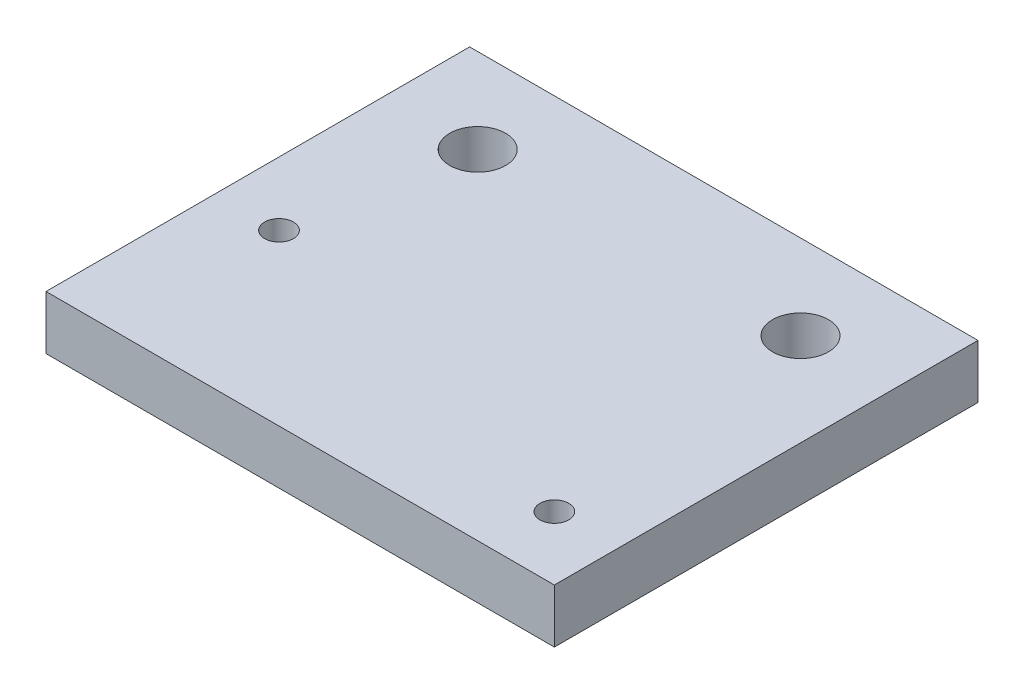
ISO-10303-21;
HEADER;
FILE_DESCRIPTION(('STEP AP214'),'2;1');
FILE_NAME('part.step','',(''),(''),'','','');
FILE_SCHEMA(('AUTOMOTIVE_DESIGN { 1 0 10303 214 1 1 1 1 }'));
ENDSEC;
DATA;
#1=APPLICATION_CONTEXT('core data for automotive mechanical design processes');
#2=APPLICATION_PROTOCOL_DEFINITION('international standard','automotive_design',2000,#1);
#3=PRODUCT_CONTEXT('',#1,'mechanical');
#4=PRODUCT('Part','Part','',(#3));
#5=PRODUCT_RELATED_PRODUCT_CATEGORY('part','',(#4));
#6=PRODUCT_DEFINITION_FORMATION('','',#4);
#7=PRODUCT_DEFINITION_CONTEXT('part definition',#1,'design');
#8=PRODUCT_DEFINITION('design','',#6,#7);
#9=PRODUCT_DEFINITION_SHAPE('','',#8);
#10=(LENGTH_UNIT() NAMED_UNIT(*) SI_UNIT(.MILLI.,.METRE.));
#11=(NAMED_UNIT(*) PLANE_ANGLE_UNIT() SI_UNIT($,.RADIAN.));
#12=(NAMED_UNIT(*) SI_UNIT($,.STERADIAN.) SOLID_ANGLE_UNIT());
#13=UNCERTAINTY_MEASURE_WITH_UNIT(LENGTH_MEASURE(1.E-05),#10,'distance_accuracy_value','');
#14=(GEOMETRIC_REPRESENTATION_CONTEXT(3) GLOBAL_UNCERTAINTY_ASSIGNED_CONTEXT((#13)) GLOBAL_UNIT_ASSIGNED_CONTEXT((#10,
#11,#12)) REPRESENTATION_CONTEXT('',''));
#15=CARTESIAN_POINT('',(0.,0.,0.));
#16=DIRECTION('',(0.,0.,1.));
#17=DIRECTION('',(1.,0.,0.));
#18=AXIS2_PLACEMENT_3D('',#15,#16,#17);
#19=CARTESIAN_POINT('',(0.,6.35,0.));
#20=DIRECTION('',(0.,1.,0.));
#21=DIRECTION('',(0.,0.,1.));
#22=AXIS2_PLACEMENT_3D('',#19,#20,#21);
#23=PLANE('',#22);
#24=CARTESIAN_POINT('',(7.5,6.35,-20.));
#25=DIRECTION('',(0.,1.,0.));
#26=DIRECTION('',(0.,0.,1.));
#27=AXIS2_PLACEMENT_3D('',#24,#25,#26);
#28=CIRCLE('',#27,1.7);
#29=CARTESIAN_POINT('',(7.5,6.35,-18.3));
#30=VERTEX_POINT('',#29);
#31=EDGE_CURVE('E145',#30,#30,#28,.T.);
#32=ORIENTED_EDGE('',*,*,#31,.F.);
#33=EDGE_LOOP('',(#32));
#34=FACE_BOUND('',#33,.T.);
#35=CARTESIAN_POINT('',(10.95,6.35,-40.));
#36=DIRECTION('',(0.,1.,0.));
#37=DIRECTION('',(0.,0.,1.));
#38=AXIS2_PLACEMENT_3D('',#35,#36,#37);
#39=CIRCLE('',#38,3.3);
#40=CARTESIAN_POINT('',(10.95,6.35,-36.7));
#41=VERTEX_POINT('',#40);
#42=EDGE_CURVE('E115',#41,#41,#39,.T.);
#43=ORIENTED_EDGE('',*,*,#42,.F.);
#44=EDGE_LOOP('',(#43));
#45=FACE_BOUND('',#44,.T.);
#46=DIRECTION('',(0.,0.,1.));
#47=VECTOR('',#46,1.);
#48=CARTESIAN_POINT('',(0.,6.35,-50.));
#49=LINE('',#48,#47);
#50=CARTESIAN_POINT('',(0.,6.35,-50.));
#51=VERTEX_POINT('',#50);
#52=CARTESIAN_POINT('',(0.,6.35,0.));
#53=VERTEX_POINT('',#52);
#54=EDGE_CURVE('E95',#51,#53,#49,.T.);
#55=ORIENTED_EDGE('',*,*,#54,.T.);
#56=DIRECTION('',(1.,0.,0.));
#57=VECTOR('',#56,1.);
#58=CARTESIAN_POINT('',(0.,6.35,0.));
#59=LINE('',#58,#57);
#60=CARTESIAN_POINT('',(60.,6.35,0.));
#61=VERTEX_POINT('',#60);
#62=EDGE_CURVE('E90',#53,#61,#59,.T.);
#63=ORIENTED_EDGE('',*,*,#62,.T.);
#64=DIRECTION('',(0.,0.,-1.));
#65=VECTOR('',#64,1.);
#66=CARTESIAN_POINT('',(60.,6.35,-50.));
#67=LINE('',#66,#65);
#68=CARTESIAN_POINT('',(60.,6.35,-50.));
#69=VERTEX_POINT('',#68);
#70=EDGE_CURVE('E93',#61,#69,#67,.T.);
#71=ORIENTED_EDGE('',*,*,#70,.T.);
#72=DIRECTION('',(-1.,0.,0.));
#73=VECTOR('',#72,1.);
#74=CARTESIAN_POINT('',(0.,6.35,-50.));
#75=LINE('',#74,#73);
#76=EDGE_CURVE('E60',#69,#51,#75,.T.);
#77=ORIENTED_EDGE('',*,*,#76,.T.);
#78=EDGE_LOOP('',(#55,#63,#71,#77));
#79=FACE_BOUND('',#78,.T.);
#80=CARTESIAN_POINT('',(49.05,6.35,-40.));
#81=DIRECTION('',(0.,1.,0.));
#82=DIRECTION('',(0.,0.,1.));
#83=AXIS2_PLACEMENT_3D('',#80,#81,#82);
#84=CIRCLE('',#83,3.3);
#85=CARTESIAN_POINT('',(49.05,6.35,-36.7));
#86=VERTEX_POINT('',#85);
#87=EDGE_CURVE('E137',#86,#86,#84,.T.);
#88=ORIENTED_EDGE('',*,*,#87,.F.);
#89=EDGE_LOOP('',(#88));
#90=FACE_BOUND('',#89,.T.);
#91=CARTESIAN_POINT('',(52.5,6.35,-7.5));
#92=DIRECTION('',(0.,1.,0.));
#93=DIRECTION('',(0.,0.,1.));
#94=AXIS2_PLACEMENT_3D('',#91,#92,#93);
#95=CIRCLE('',#94,1.7);
#96=CARTESIAN_POINT('',(52.5,6.35,-5.8));
#97=VERTEX_POINT('',#96);
#98=EDGE_CURVE('E153',#97,#97,#95,.T.);
#99=ORIENTED_EDGE('',*,*,#98,.F.);
#100=EDGE_LOOP('',(#99));
#101=FACE_BOUND('',#100,.T.);
#102=ADVANCED_FACE('F42',(#34,#45,#79,#90,#101),#23,.T.);
#103=CARTESIAN_POINT('',(0.,0.,0.));
#104=DIRECTION('',(0.,1.,0.));
#105=DIRECTION('',(0.,0.,1.));
#106=AXIS2_PLACEMENT_3D('',#103,#104,#105);
#107=PLANE('',#106);
#108=DIRECTION('',(0.,0.,1.));
#109=VECTOR('',#108,1.);
#110=CARTESIAN_POINT('',(0.,0.,-50.));
#111=LINE('',#110,#109);
#112=CARTESIAN_POINT('',(0.,0.,-50.));
#113=VERTEX_POINT('',#112);
#114=CARTESIAN_POINT('',(0.,0.,0.));
#115=VERTEX_POINT('',#114);
#116=EDGE_CURVE('E111',#113,#115,#111,.T.);
#117=ORIENTED_EDGE('',*,*,#116,.F.);
#118=DIRECTION('',(-1.,0.,0.));
#119=VECTOR('',#118,1.);
#120=CARTESIAN_POINT('',(0.,0.,-50.));
#121=LINE('',#120,#119);
#122=CARTESIAN_POINT('',(60.,0.,-50.));
#123=VERTEX_POINT('',#122);
#124=EDGE_CURVE('E83',#123,#113,#121,.T.);
#125=ORIENTED_EDGE('',*,*,#124,.F.);
#126=DIRECTION('',(0.,0.,-1.));
#127=VECTOR('',#126,1.);
#128=CARTESIAN_POINT('',(60.,0.,-50.));
#129=LINE('',#128,#127);
#130=CARTESIAN_POINT('',(60.,0.,0.));
#131=VERTEX_POINT('',#130);
#132=EDGE_CURVE('E77',#131,#123,#129,.T.);
#133=ORIENTED_EDGE('',*,*,#132,.F.);
#134=DIRECTION('',(1.,0.,0.));
#135=VECTOR('',#134,1.);
#136=CARTESIAN_POINT('',(0.,0.,0.));
#137=LINE('',#136,#135);
#138=EDGE_CURVE('E100',#115,#131,#137,.T.);
#139=ORIENTED_EDGE('',*,*,#138,.F.);
#140=EDGE_LOOP('',(#117,#125,#133,#139));
#141=FACE_BOUND('',#140,.T.);
#142=CARTESIAN_POINT('',(10.95,0.,-40.));
#143=DIRECTION('',(0.,1.,0.));
#144=DIRECTION('',(0.,0.,1.));
#145=AXIS2_PLACEMENT_3D('',#142,#143,#144);
#146=CIRCLE('',#145,3.3);
#147=CARTESIAN_POINT('',(10.95,0.,-36.7));
#148=VERTEX_POINT('',#147);
#149=EDGE_CURVE('E133',#148,#148,#146,.T.);
#150=ORIENTED_EDGE('',*,*,#149,.T.);
#151=EDGE_LOOP('',(#150));
#152=FACE_BOUND('',#151,.T.);
#153=CARTESIAN_POINT('',(49.05,0.,-40.));
#154=DIRECTION('',(0.,1.,0.));
#155=DIRECTION('',(0.,0.,1.));
#156=AXIS2_PLACEMENT_3D('',#153,#154,#155);
#157=CIRCLE('',#156,3.3);
#158=CARTESIAN_POINT('',(49.05,0.,-36.7));
#159=VERTEX_POINT('',#158);
#160=EDGE_CURVE('E141',#159,#159,#157,.T.);
#161=ORIENTED_EDGE('',*,*,#160,.T.);
#162=EDGE_LOOP('',(#161));
#163=FACE_BOUND('',#162,.T.);
#164=CARTESIAN_POINT('',(7.5,0.,-20.));
#165=DIRECTION('',(0.,1.,0.));
#166=DIRECTION('',(0.,0.,1.));
#167=AXIS2_PLACEMENT_3D('',#164,#165,#166);
#168=CIRCLE('',#167,1.7);
#169=CARTESIAN_POINT('',(7.5,0.,-18.3));
#170=VERTEX_POINT('',#169);
#171=EDGE_CURVE('E149',#170,#170,#168,.T.);
#172=ORIENTED_EDGE('',*,*,#171,.T.);
#173=EDGE_LOOP('',(#172));
#174=FACE_BOUND('',#173,.T.);
#175=CARTESIAN_POINT('',(52.5,0.,-7.5));
#176=DIRECTION('',(0.,1.,0.));
#177=DIRECTION('',(0.,0.,1.));
#178=AXIS2_PLACEMENT_3D('',#175,#176,#177);
#179=CIRCLE('',#178,1.7);
#180=CARTESIAN_POINT('',(52.5,0.,-5.8));
#181=VERTEX_POINT('',#180);
#182=EDGE_CURVE('E157',#181,#181,#179,.T.);
#183=ORIENTED_EDGE('',*,*,#182,.T.);
#184=EDGE_LOOP('',(#183));
#185=FACE_BOUND('',#184,.T.);
#186=ADVANCED_FACE('F128',(#141,#152,#163,#174,#185),#107,.F.);
#187=CARTESIAN_POINT('',(0.,6.35,-50.));
#188=DIRECTION('',(1.,0.,0.));
#189=DIRECTION('',(0.,0.,-1.));
#190=AXIS2_PLACEMENT_3D('',#187,#188,#189);
#191=PLANE('',#190);
#192=ORIENTED_EDGE('',*,*,#116,.T.);
#193=DIRECTION('',(0.,-1.,0.));
#194=VECTOR('',#193,1.);
#195=CARTESIAN_POINT('',(0.,6.35,0.));
#196=LINE('',#195,#194);
#197=EDGE_CURVE('E11',#53,#115,#196,.T.);
#198=ORIENTED_EDGE('',*,*,#197,.F.);
#199=ORIENTED_EDGE('',*,*,#54,.F.);
#200=DIRECTION('',(0.,-1.,0.));
#201=VECTOR('',#200,1.);
#202=CARTESIAN_POINT('',(0.,6.35,-50.));
#203=LINE('',#202,#201);
#204=EDGE_CURVE('E107',#51,#113,#203,.T.);
#205=ORIENTED_EDGE('',*,*,#204,.T.);
#206=EDGE_LOOP('',(#192,#198,#199,#205));
#207=FACE_BOUND('',#206,.T.);
#208=ADVANCED_FACE('F44',(#207),#191,.F.);
#209=CARTESIAN_POINT('',(0.,6.35,0.));
#210=DIRECTION('',(0.,0.,-1.));
#211=DIRECTION('',(-1.,0.,0.));
#212=AXIS2_PLACEMENT_3D('',#209,#210,#211);
#213=PLANE('',#212);
#214=ORIENTED_EDGE('',*,*,#138,.T.);
#215=DIRECTION('',(0.,-1.,0.));
#216=VECTOR('',#215,1.);
#217=CARTESIAN_POINT('',(60.,6.35,0.));
#218=LINE('',#217,#216);
#219=EDGE_CURVE('E52',#61,#131,#218,.T.);
#220=ORIENTED_EDGE('',*,*,#219,.F.);
#221=ORIENTED_EDGE('',*,*,#62,.F.);
#222=ORIENTED_EDGE('',*,*,#197,.T.);
#223=EDGE_LOOP('',(#214,#220,#221,#222));
#224=FACE_BOUND('',#223,.T.);
#225=ADVANCED_FACE('F99',(#224),#213,.F.);
#226=CARTESIAN_POINT('',(60.,6.35,-50.));
#227=DIRECTION('',(-1.,0.,0.));
#228=DIRECTION('',(0.,0.,1.));
#229=AXIS2_PLACEMENT_3D('',#226,#227,#228);
#230=PLANE('',#229);
#231=ORIENTED_EDGE('',*,*,#132,.T.);
#232=DIRECTION('',(0.,-1.,0.));
#233=VECTOR('',#232,1.);
#234=CARTESIAN_POINT('',(60.,6.35,-50.));
#235=LINE('',#234,#233);
#236=EDGE_CURVE('E102',#69,#123,#235,.T.);
#237=ORIENTED_EDGE('',*,*,#236,.F.);
#238=ORIENTED_EDGE('',*,*,#70,.F.);
#239=ORIENTED_EDGE('',*,*,#219,.T.);
#240=EDGE_LOOP('',(#231,#237,#238,#239));
#241=FACE_BOUND('',#240,.T.);
#242=ADVANCED_FACE('F103',(#241),#230,.F.);
#243=CARTESIAN_POINT('',(0.,6.35,-50.));
#244=DIRECTION('',(0.,0.,1.));
#245=DIRECTION('',(1.,0.,0.));
#246=AXIS2_PLACEMENT_3D('',#243,#244,#245);
#247=PLANE('',#246);
#248=ORIENTED_EDGE('',*,*,#124,.T.);
#249=ORIENTED_EDGE('',*,*,#204,.F.);
#250=ORIENTED_EDGE('',*,*,#76,.F.);
#251=ORIENTED_EDGE('',*,*,#236,.T.);
#252=EDGE_LOOP('',(#248,#249,#250,#251));
#253=FACE_BOUND('',#252,.T.);
#254=ADVANCED_FACE('F125',(#253),#247,.F.);
#255=CARTESIAN_POINT('',(10.95,6.35,-40.));
#256=DIRECTION('',(0.,-1.,0.));
#257=DIRECTION('',(0.,0.,-1.));
#258=AXIS2_PLACEMENT_3D('',#255,#256,#257);
#259=CYLINDRICAL_SURFACE('',#258,3.3);
#260=ORIENTED_EDGE('',*,*,#42,.T.);
#261=EDGE_LOOP('',(#260));
#262=FACE_BOUND('',#261,.T.);
#263=ORIENTED_EDGE('',*,*,#149,.F.);
#264=EDGE_LOOP('',(#263));
#265=FACE_BOUND('',#264,.T.);
#266=ADVANCED_FACE('F178',(#262,#265),#259,.F.);
#267=CARTESIAN_POINT('',(49.05,6.35,-40.));
#268=DIRECTION('',(0.,-1.,0.));
#269=DIRECTION('',(0.,0.,-1.));
#270=AXIS2_PLACEMENT_3D('',#267,#268,#269);
#271=CYLINDRICAL_SURFACE('',#270,3.3);
#272=ORIENTED_EDGE('',*,*,#87,.T.);
#273=EDGE_LOOP('',(#272));
#274=FACE_BOUND('',#273,.T.);
#275=ORIENTED_EDGE('',*,*,#160,.F.);
#276=EDGE_LOOP('',(#275));
#277=FACE_BOUND('',#276,.T.);
#278=ADVANCED_FACE('F232',(#274,#277),#271,.F.);
#279=CARTESIAN_POINT('',(7.5,6.35,-20.));
#280=DIRECTION('',(0.,-1.,0.));
#281=DIRECTION('',(0.,0.,-1.));
#282=AXIS2_PLACEMENT_3D('',#279,#280,#281);
#283=CYLINDRICAL_SURFACE('',#282,1.7);
#284=ORIENTED_EDGE('',*,*,#31,.T.);
#285=EDGE_LOOP('',(#284));
#286=FACE_BOUND('',#285,.T.);
#287=ORIENTED_EDGE('',*,*,#171,.F.);
#288=EDGE_LOOP('',(#287));
#289=FACE_BOUND('',#288,.T.);
#290=ADVANCED_FACE('F241',(#286,#289),#283,.F.);
#291=CARTESIAN_POINT('',(52.5,6.35,-7.5));
#292=DIRECTION('',(0.,-1.,0.));
#293=DIRECTION('',(0.,0.,-1.));
#294=AXIS2_PLACEMENT_3D('',#291,#292,#293);
#295=CYLINDRICAL_SURFACE('',#294,1.7);
#296=ORIENTED_EDGE('',*,*,#98,.T.);
#297=EDGE_LOOP('',(#296));
#298=FACE_BOUND('',#297,.T.);
#299=ORIENTED_EDGE('',*,*,#182,.F.);
#300=EDGE_LOOP('',(#299));
#301=FACE_BOUND('',#300,.T.);
#302=ADVANCED_FACE('F165',(#298,#301),#295,.F.);
#303=CLOSED_SHELL('',(#102,#186,#208,#225,#242,#254,#266,#278,#290,#302));
#304=MANIFOLD_SOLID_BREP('B2',#303);
#305=ADVANCED_BREP_SHAPE_REPRESENTATION('',(#18,#304),#14);
#306=SHAPE_DEFINITION_REPRESENTATION(#9,#305);
ENDSEC;
END-ISO-10303-21;
